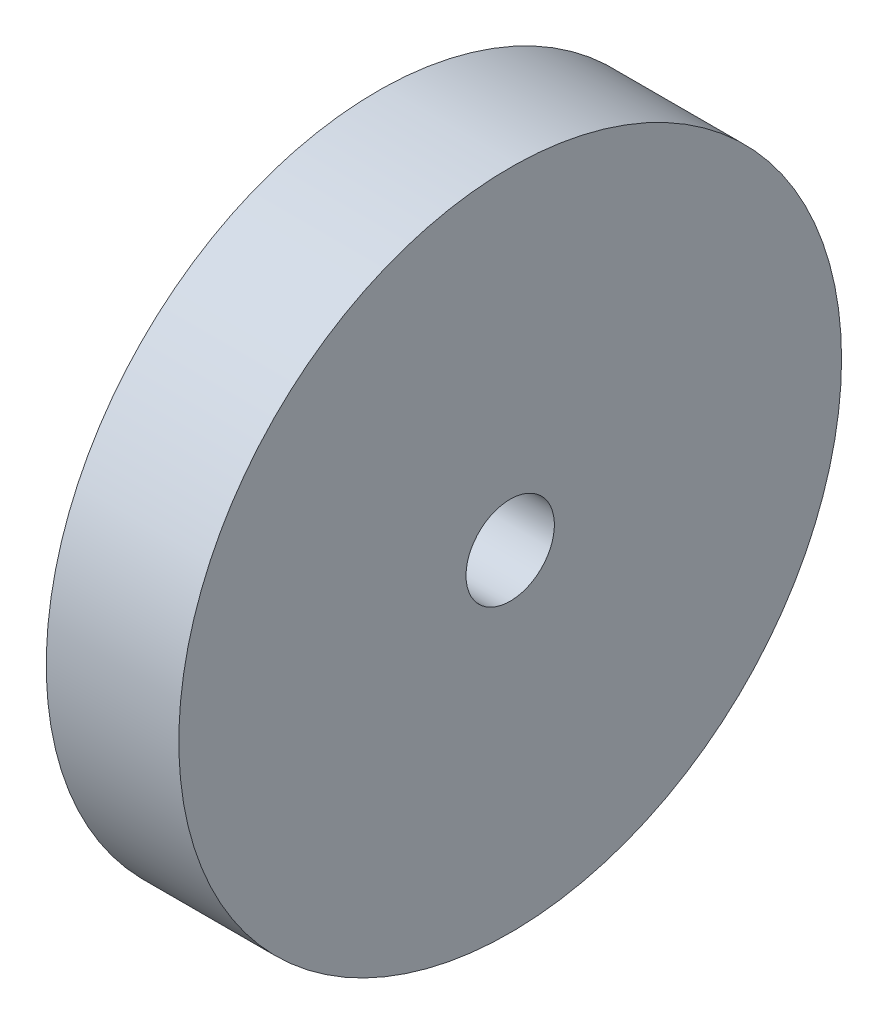
ISO-10303-21;
HEADER;
FILE_DESCRIPTION(('STEP AP214'),'2;1');
FILE_NAME('part.step','',(''),(''),'','','');
FILE_SCHEMA(('AUTOMOTIVE_DESIGN { 1 0 10303 214 1 1 1 1 }'));
ENDSEC;
DATA;
#1=APPLICATION_CONTEXT('core data for automotive mechanical design processes');
#2=APPLICATION_PROTOCOL_DEFINITION('international standard','automotive_design',2000,#1);
#3=PRODUCT_CONTEXT('',#1,'mechanical');
#4=PRODUCT('Part','Part','',(#3));
#5=PRODUCT_RELATED_PRODUCT_CATEGORY('part','',(#4));
#6=PRODUCT_DEFINITION_FORMATION('','',#4);
#7=PRODUCT_DEFINITION_CONTEXT('part definition',#1,'design');
#8=PRODUCT_DEFINITION('design','',#6,#7);
#9=PRODUCT_DEFINITION_SHAPE('','',#8);
#10=(LENGTH_UNIT() NAMED_UNIT(*) SI_UNIT(.MILLI.,.METRE.));
#11=(NAMED_UNIT(*) PLANE_ANGLE_UNIT() SI_UNIT($,.RADIAN.));
#12=(NAMED_UNIT(*) SI_UNIT($,.STERADIAN.) SOLID_ANGLE_UNIT());
#13=UNCERTAINTY_MEASURE_WITH_UNIT(LENGTH_MEASURE(1.E-05),#10,'distance_accuracy_value','');
#14=(GEOMETRIC_REPRESENTATION_CONTEXT(3) GLOBAL_UNCERTAINTY_ASSIGNED_CONTEXT((#13)) GLOBAL_UNIT_ASSIGNED_CONTEXT((#10,
#11,#12)) REPRESENTATION_CONTEXT('',''));
#15=CARTESIAN_POINT('',(0.,0.,0.));
#16=DIRECTION('',(0.,0.,1.));
#17=DIRECTION('',(1.,0.,0.));
#18=AXIS2_PLACEMENT_3D('',#15,#16,#17);
#19=CARTESIAN_POINT('',(15.,0.,0.));
#20=DIRECTION('',(-1.,0.,0.));
#21=DIRECTION('',(0.,0.,1.));
#22=AXIS2_PLACEMENT_3D('',#19,#20,#21);
#23=CYLINDRICAL_SURFACE('',#22,37.5);
#24=CARTESIAN_POINT('',(15.,0.,0.));
#25=DIRECTION('',(1.,0.,0.));
#26=DIRECTION('',(0.,0.,-1.));
#27=AXIS2_PLACEMENT_3D('',#24,#25,#26);
#28=CIRCLE('',#27,37.5);
#29=CARTESIAN_POINT('',(15.,0.,-37.5));
#30=VERTEX_POINT('',#29);
#31=EDGE_CURVE('E10',#30,#30,#28,.T.);
#32=ORIENTED_EDGE('',*,*,#31,.F.);
#33=EDGE_LOOP('',(#32));
#34=FACE_BOUND('',#33,.T.);
#35=CARTESIAN_POINT('',(0.,0.,0.));
#36=DIRECTION('',(1.,0.,0.));
#37=DIRECTION('',(0.,0.,-1.));
#38=AXIS2_PLACEMENT_3D('',#35,#36,#37);
#39=CIRCLE('',#38,37.5);
#40=CARTESIAN_POINT('',(0.,0.,-37.5));
#41=VERTEX_POINT('',#40);
#42=EDGE_CURVE('E35',#41,#41,#39,.T.);
#43=ORIENTED_EDGE('',*,*,#42,.T.);
#44=EDGE_LOOP('',(#43));
#45=FACE_BOUND('',#44,.T.);
#46=ADVANCED_FACE('F32',(#34,#45),#23,.T.);
#47=CARTESIAN_POINT('',(15.,0.,0.));
#48=DIRECTION('',(1.,0.,0.));
#49=DIRECTION('',(0.,0.,-1.));
#50=AXIS2_PLACEMENT_3D('',#47,#48,#49);
#51=PLANE('',#50);
#52=CARTESIAN_POINT('',(15.,0.,0.));
#53=DIRECTION('',(-1.,0.,0.));
#54=DIRECTION('',(0.,0.,1.));
#55=AXIS2_PLACEMENT_3D('',#52,#53,#54);
#56=CIRCLE('',#55,5.);
#57=CARTESIAN_POINT('',(15.,0.,5.));
#58=VERTEX_POINT('',#57);
#59=EDGE_CURVE('E42',#58,#58,#56,.T.);
#60=ORIENTED_EDGE('',*,*,#59,.T.);
#61=EDGE_LOOP('',(#60));
#62=FACE_BOUND('',#61,.T.);
#63=ORIENTED_EDGE('',*,*,#31,.T.);
#64=EDGE_LOOP('',(#63));
#65=FACE_BOUND('',#64,.T.);
#66=ADVANCED_FACE('F50',(#62,#65),#51,.T.);
#67=CARTESIAN_POINT('',(0.,0.,0.));
#68=DIRECTION('',(1.,0.,0.));
#69=DIRECTION('',(0.,0.,-1.));
#70=AXIS2_PLACEMENT_3D('',#67,#68,#69);
#71=PLANE('',#70);
#72=CARTESIAN_POINT('',(0.,0.,0.));
#73=DIRECTION('',(-1.,0.,0.));
#74=DIRECTION('',(0.,0.,1.));
#75=AXIS2_PLACEMENT_3D('',#72,#73,#74);
#76=CIRCLE('',#75,5.);
#77=CARTESIAN_POINT('',(0.,0.,5.));
#78=VERTEX_POINT('',#77);
#79=EDGE_CURVE('E44',#78,#78,#76,.T.);
#80=ORIENTED_EDGE('',*,*,#79,.F.);
#81=EDGE_LOOP('',(#80));
#82=FACE_BOUND('',#81,.T.);
#83=ORIENTED_EDGE('',*,*,#42,.F.);
#84=EDGE_LOOP('',(#83));
#85=FACE_BOUND('',#84,.T.);
#86=ADVANCED_FACE('F55',(#82,#85),#71,.F.);
#87=CARTESIAN_POINT('',(15.,0.,0.));
#88=DIRECTION('',(-1.,0.,0.));
#89=DIRECTION('',(0.,0.,1.));
#90=AXIS2_PLACEMENT_3D('',#87,#88,#89);
#91=CYLINDRICAL_SURFACE('',#90,5.);
#92=ORIENTED_EDGE('',*,*,#59,.F.);
#93=EDGE_LOOP('',(#92));
#94=FACE_BOUND('',#93,.T.);
#95=ORIENTED_EDGE('',*,*,#79,.T.);
#96=EDGE_LOOP('',(#95));
#97=FACE_BOUND('',#96,.T.);
#98=ADVANCED_FACE('F52',(#94,#97),#91,.F.);
#99=CLOSED_SHELL('',(#46,#66,#86,#98));
#100=MANIFOLD_SOLID_BREP('B2',#99);
#101=ADVANCED_BREP_SHAPE_REPRESENTATION('',(#18,#100),#14);
#102=SHAPE_DEFINITION_REPRESENTATION(#9,#101);
ENDSEC;
END-ISO-10303-21;
